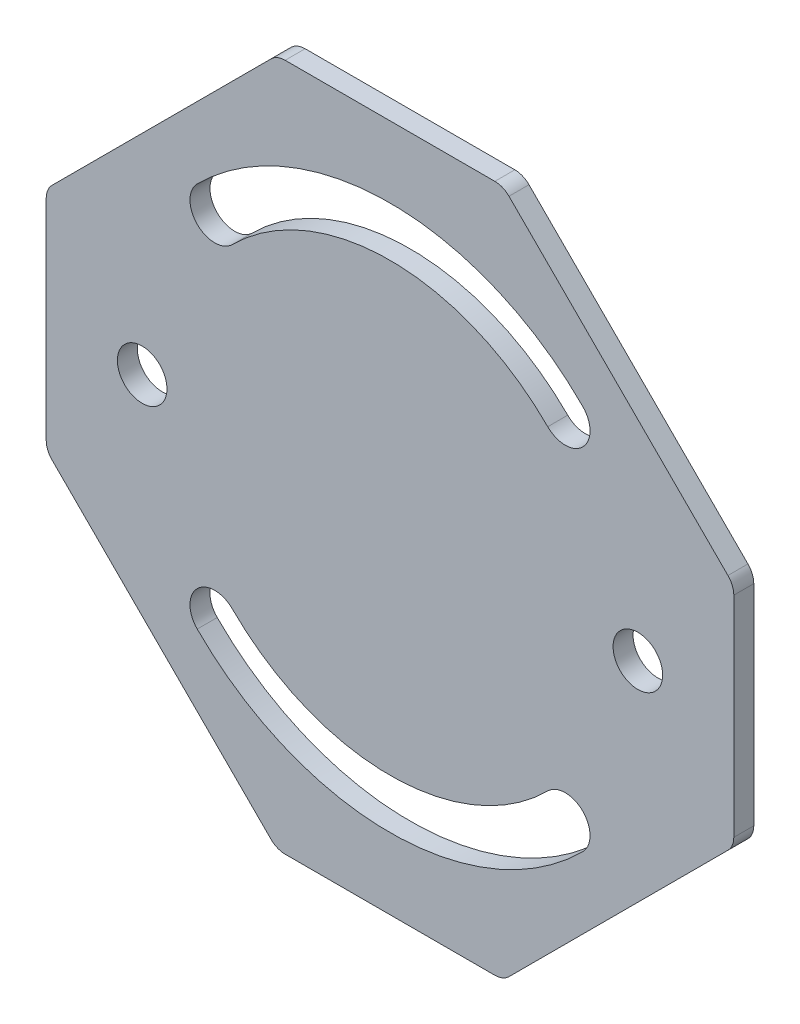
ISO-10303-21;
HEADER;
FILE_DESCRIPTION(('STEP AP214'),'2;1');
FILE_NAME('part.step','',(''),(''),'','','');
FILE_SCHEMA(('AUTOMOTIVE_DESIGN { 1 0 10303 214 1 1 1 1 }'));
ENDSEC;
DATA;
#1=APPLICATION_CONTEXT('core data for automotive mechanical design processes');
#2=APPLICATION_PROTOCOL_DEFINITION('international standard','automotive_design',2000,#1);
#3=PRODUCT_CONTEXT('',#1,'mechanical');
#4=PRODUCT('Part','Part','',(#3));
#5=PRODUCT_RELATED_PRODUCT_CATEGORY('part','',(#4));
#6=PRODUCT_DEFINITION_FORMATION('','',#4);
#7=PRODUCT_DEFINITION_CONTEXT('part definition',#1,'design');
#8=PRODUCT_DEFINITION('design','',#6,#7);
#9=PRODUCT_DEFINITION_SHAPE('','',#8);
#10=(LENGTH_UNIT() NAMED_UNIT(*) SI_UNIT(.MILLI.,.METRE.));
#11=(NAMED_UNIT(*) PLANE_ANGLE_UNIT() SI_UNIT($,.RADIAN.));
#12=(NAMED_UNIT(*) SI_UNIT($,.STERADIAN.) SOLID_ANGLE_UNIT());
#13=UNCERTAINTY_MEASURE_WITH_UNIT(LENGTH_MEASURE(1.E-05),#10,'distance_accuracy_value','');
#14=(GEOMETRIC_REPRESENTATION_CONTEXT(3) GLOBAL_UNCERTAINTY_ASSIGNED_CONTEXT((#13)) GLOBAL_UNIT_ASSIGNED_CONTEXT((#10,
#11,#12)) REPRESENTATION_CONTEXT('',''));
#15=CARTESIAN_POINT('',(0.,0.,0.));
#16=DIRECTION('',(0.,0.,1.));
#17=DIRECTION('',(1.,0.,0.));
#18=AXIS2_PLACEMENT_3D('',#15,#16,#17);
#19=CARTESIAN_POINT('',(0.,0.,2.5));
#20=DIRECTION('',(0.,0.,-1.));
#21=DIRECTION('',(-1.,0.,0.));
#22=AXIS2_PLACEMENT_3D('',#19,#20,#21);
#23=PLANE('',#22);
#24=CARTESIAN_POINT('',(-21.9203102167831,-21.9203102167829,2.5));
#25=DIRECTION('',(0.,0.,1.));
#26=DIRECTION('',(1.,0.,0.));
#27=AXIS2_PLACEMENT_3D('',#24,#25,#26);
#28=CIRCLE('',#27,3.1);
#29=CARTESIAN_POINT('',(-19.7282791951048,-19.7282791951046,2.5));
#30=VERTEX_POINT('',#29);
#31=CARTESIAN_POINT('',(-24.1123412384614,-24.1123412384612,2.5));
#32=VERTEX_POINT('',#31);
#33=EDGE_CURVE('E219',#30,#32,#28,.T.);
#34=ORIENTED_EDGE('',*,*,#33,.F.);
#35=CARTESIAN_POINT('',(0.,0.,2.5));
#36=DIRECTION('',(0.,0.,-1.));
#37=DIRECTION('',(1.,0.,0.));
#38=AXIS2_PLACEMENT_3D('',#35,#36,#37);
#39=CIRCLE('',#38,27.9);
#40=CARTESIAN_POINT('',(19.7282791951048,-19.7282791951046,2.5));
#41=VERTEX_POINT('',#40);
#42=EDGE_CURVE('E227',#41,#30,#39,.T.);
#43=ORIENTED_EDGE('',*,*,#42,.F.);
#44=CARTESIAN_POINT('',(21.9203102167831,-21.9203102167829,2.5));
#45=DIRECTION('',(0.,0.,1.));
#46=DIRECTION('',(1.,0.,0.));
#47=AXIS2_PLACEMENT_3D('',#44,#45,#46);
#48=CIRCLE('',#47,3.1);
#49=CARTESIAN_POINT('',(24.1123412384614,-24.1123412384611,2.5));
#50=VERTEX_POINT('',#49);
#51=EDGE_CURVE('E224',#50,#41,#48,.T.);
#52=ORIENTED_EDGE('',*,*,#51,.F.);
#53=CARTESIAN_POINT('',(0.,0.,2.5));
#54=DIRECTION('',(0.,0.,1.));
#55=DIRECTION('',(1.,0.,0.));
#56=AXIS2_PLACEMENT_3D('',#53,#54,#55);
#57=CIRCLE('',#56,34.1);
#58=EDGE_CURVE('E221',#32,#50,#57,.T.);
#59=ORIENTED_EDGE('',*,*,#58,.F.);
#60=EDGE_LOOP('',(#34,#43,#52,#59));
#61=FACE_BOUND('',#60,.T.);
#62=DIRECTION('',(-0.707106781186548,0.707106781186547,0.));
#63=VECTOR('',#62,1.);
#64=CARTESIAN_POINT('',(14.15,43.,2.5));
#65=LINE('',#64,#63);
#66=CARTESIAN_POINT('',(42.2677669529664,14.8822330470336,2.5));
#67=VERTEX_POINT('',#66);
#68=CARTESIAN_POINT('',(14.8822330470336,42.2677669529664,2.5));
#69=VERTEX_POINT('',#68);
#70=EDGE_CURVE('E282',#67,#69,#65,.T.);
#71=ORIENTED_EDGE('',*,*,#70,.T.);
#72=CARTESIAN_POINT('',(13.1144660940673,40.5,2.5));
#73=DIRECTION('',(0.,0.,-1.));
#74=DIRECTION('',(-1.,0.,0.));
#75=AXIS2_PLACEMENT_3D('',#72,#73,#74);
#76=CIRCLE('',#75,2.5);
#77=CARTESIAN_POINT('',(13.1144660940673,43.,2.5));
#78=VERTEX_POINT('',#77);
#79=EDGE_CURVE('E345',#69,#78,#76,.F.);
#80=ORIENTED_EDGE('',*,*,#79,.T.);
#81=DIRECTION('',(-1.,0.,0.));
#82=VECTOR('',#81,1.);
#83=CARTESIAN_POINT('',(-14.15,43.,2.5));
#84=LINE('',#83,#82);
#85=CARTESIAN_POINT('',(-13.1144660940673,43.,2.5));
#86=VERTEX_POINT('',#85);
#87=EDGE_CURVE('E262',#78,#86,#84,.T.);
#88=ORIENTED_EDGE('',*,*,#87,.T.);
#89=CARTESIAN_POINT('',(-13.1144660940673,40.5,2.5));
#90=DIRECTION('',(0.,0.,-1.));
#91=DIRECTION('',(-1.,0.,0.));
#92=AXIS2_PLACEMENT_3D('',#89,#90,#91);
#93=CIRCLE('',#92,2.5);
#94=CARTESIAN_POINT('',(-14.8822330470336,42.2677669529664,2.5));
#95=VERTEX_POINT('',#94);
#96=EDGE_CURVE('E332',#86,#95,#93,.F.);
#97=ORIENTED_EDGE('',*,*,#96,.T.);
#98=DIRECTION('',(-0.707106781186547,-0.707106781186548,0.));
#99=VECTOR('',#98,1.);
#100=CARTESIAN_POINT('',(-43.,14.15,2.5));
#101=LINE('',#100,#99);
#102=CARTESIAN_POINT('',(-42.2677669529664,14.8822330470336,2.5));
#103=VERTEX_POINT('',#102);
#104=EDGE_CURVE('E265',#95,#103,#101,.T.);
#105=ORIENTED_EDGE('',*,*,#104,.T.);
#106=CARTESIAN_POINT('',(-40.5,13.1144660940673,2.5));
#107=DIRECTION('',(0.,0.,-1.));
#108=DIRECTION('',(-1.,0.,0.));
#109=AXIS2_PLACEMENT_3D('',#106,#107,#108);
#110=CIRCLE('',#109,2.5);
#111=CARTESIAN_POINT('',(-43.,13.1144660940673,2.5));
#112=VERTEX_POINT('',#111);
#113=EDGE_CURVE('E334',#103,#112,#110,.F.);
#114=ORIENTED_EDGE('',*,*,#113,.T.);
#115=DIRECTION('',(0.,-1.,0.));
#116=VECTOR('',#115,1.);
#117=CARTESIAN_POINT('',(-43.,14.15,2.5));
#118=LINE('',#117,#116);
#119=CARTESIAN_POINT('',(-43.,-13.1144660940673,2.5));
#120=VERTEX_POINT('',#119);
#121=EDGE_CURVE('E269',#112,#120,#118,.T.);
#122=ORIENTED_EDGE('',*,*,#121,.T.);
#123=CARTESIAN_POINT('',(-40.5,-13.1144660940673,2.5));
#124=DIRECTION('',(0.,0.,-1.));
#125=DIRECTION('',(-1.,0.,0.));
#126=AXIS2_PLACEMENT_3D('',#123,#124,#125);
#127=CIRCLE('',#126,2.5);
#128=CARTESIAN_POINT('',(-42.2677669529664,-14.8822330470336,2.5));
#129=VERTEX_POINT('',#128);
#130=EDGE_CURVE('E336',#120,#129,#127,.F.);
#131=ORIENTED_EDGE('',*,*,#130,.T.);
#132=DIRECTION('',(0.707106781186548,-0.707106781186547,0.));
#133=VECTOR('',#132,1.);
#134=CARTESIAN_POINT('',(-43.,-14.15,2.5));
#135=LINE('',#134,#133);
#136=CARTESIAN_POINT('',(-14.8822330470336,-42.2677669529664,2.5));
#137=VERTEX_POINT('',#136);
#138=EDGE_CURVE('E272',#129,#137,#135,.T.);
#139=ORIENTED_EDGE('',*,*,#138,.T.);
#140=CARTESIAN_POINT('',(-13.1144660940673,-40.5,2.5));
#141=DIRECTION('',(0.,0.,-1.));
#142=DIRECTION('',(-1.,0.,0.));
#143=AXIS2_PLACEMENT_3D('',#140,#141,#142);
#144=CIRCLE('',#143,2.5);
#145=CARTESIAN_POINT('',(-13.1144660940673,-43.,2.5));
#146=VERTEX_POINT('',#145);
#147=EDGE_CURVE('E338',#137,#146,#144,.F.);
#148=ORIENTED_EDGE('',*,*,#147,.T.);
#149=DIRECTION('',(1.,0.,0.));
#150=VECTOR('',#149,1.);
#151=CARTESIAN_POINT('',(-14.15,-43.,2.5));
#152=LINE('',#151,#150);
#153=CARTESIAN_POINT('',(13.1144660940673,-43.,2.5));
#154=VERTEX_POINT('',#153);
#155=EDGE_CURVE('E275',#146,#154,#152,.T.);
#156=ORIENTED_EDGE('',*,*,#155,.T.);
#157=CARTESIAN_POINT('',(13.1144660940673,-40.5,2.5));
#158=DIRECTION('',(0.,0.,-1.));
#159=DIRECTION('',(-1.,0.,0.));
#160=AXIS2_PLACEMENT_3D('',#157,#158,#159);
#161=CIRCLE('',#160,2.5);
#162=CARTESIAN_POINT('',(14.8822330470336,-42.2677669529664,2.5));
#163=VERTEX_POINT('',#162);
#164=EDGE_CURVE('E340',#154,#163,#161,.F.);
#165=ORIENTED_EDGE('',*,*,#164,.T.);
#166=DIRECTION('',(0.707106781186548,0.707106781186548,0.));
#167=VECTOR('',#166,1.);
#168=CARTESIAN_POINT('',(14.15,-43.,2.5));
#169=LINE('',#168,#167);
#170=CARTESIAN_POINT('',(42.2677669529664,-14.8822330470336,2.5));
#171=VERTEX_POINT('',#170);
#172=EDGE_CURVE('E278',#163,#171,#169,.T.);
#173=ORIENTED_EDGE('',*,*,#172,.T.);
#174=CARTESIAN_POINT('',(40.5,-13.1144660940673,2.5));
#175=DIRECTION('',(0.,0.,-1.));
#176=DIRECTION('',(-1.,0.,0.));
#177=AXIS2_PLACEMENT_3D('',#174,#175,#176);
#178=CIRCLE('',#177,2.5);
#179=CARTESIAN_POINT('',(43.,-13.1144660940673,2.5));
#180=VERTEX_POINT('',#179);
#181=EDGE_CURVE('E37',#171,#180,#178,.F.);
#182=ORIENTED_EDGE('',*,*,#181,.T.);
#183=DIRECTION('',(0.,1.,0.));
#184=VECTOR('',#183,1.);
#185=CARTESIAN_POINT('',(43.,14.15,2.5));
#186=LINE('',#185,#184);
#187=CARTESIAN_POINT('',(43.,13.1144660940673,2.5));
#188=VERTEX_POINT('',#187);
#189=EDGE_CURVE('E280',#180,#188,#186,.T.);
#190=ORIENTED_EDGE('',*,*,#189,.T.);
#191=CARTESIAN_POINT('',(40.5,13.1144660940673,2.5));
#192=DIRECTION('',(0.,0.,-1.));
#193=DIRECTION('',(-1.,0.,0.));
#194=AXIS2_PLACEMENT_3D('',#191,#192,#193);
#195=CIRCLE('',#194,2.5);
#196=EDGE_CURVE('E343',#188,#67,#195,.F.);
#197=ORIENTED_EDGE('',*,*,#196,.T.);
#198=EDGE_LOOP('',(#71,#80,#88,#97,#105,#114,#122,#131,#139,#148,#156,#165,#173,#182,#190,#197));
#199=FACE_BOUND('',#198,.T.);
#200=CARTESIAN_POINT('',(-31.,0.,2.5));
#201=DIRECTION('',(0.,0.,1.));
#202=DIRECTION('',(1.,0.,0.));
#203=AXIS2_PLACEMENT_3D('',#200,#201,#202);
#204=CIRCLE('',#203,3.1);
#205=CARTESIAN_POINT('',(-27.9,0.,2.5));
#206=VERTEX_POINT('',#205);
#207=EDGE_CURVE('E256',#206,#206,#204,.T.);
#208=ORIENTED_EDGE('',*,*,#207,.F.);
#209=EDGE_LOOP('',(#208));
#210=FACE_BOUND('',#209,.T.);
#211=CARTESIAN_POINT('',(31.,0.,2.5));
#212=DIRECTION('',(0.,0.,1.));
#213=DIRECTION('',(1.,0.,0.));
#214=AXIS2_PLACEMENT_3D('',#211,#212,#213);
#215=CIRCLE('',#214,3.1);
#216=CARTESIAN_POINT('',(34.1,0.,2.5));
#217=VERTEX_POINT('',#216);
#218=EDGE_CURVE('E250',#217,#217,#215,.T.);
#219=ORIENTED_EDGE('',*,*,#218,.F.);
#220=EDGE_LOOP('',(#219));
#221=FACE_BOUND('',#220,.T.);
#222=CARTESIAN_POINT('',(-21.9203102167831,21.9203102167829,2.5));
#223=DIRECTION('',(0.,0.,1.));
#224=DIRECTION('',(-1.,0.,0.));
#225=AXIS2_PLACEMENT_3D('',#222,#223,#224);
#226=CIRCLE('',#225,3.10000000000001);
#227=CARTESIAN_POINT('',(-24.1123412384614,24.1123412384612,2.5));
#228=VERTEX_POINT('',#227);
#229=CARTESIAN_POINT('',(-19.7282791951048,19.7282791951046,2.5));
#230=VERTEX_POINT('',#229);
#231=EDGE_CURVE('E178',#228,#230,#226,.T.);
#232=ORIENTED_EDGE('',*,*,#231,.F.);
#233=CARTESIAN_POINT('',(0.,0.,2.5));
#234=DIRECTION('',(0.,0.,1.));
#235=DIRECTION('',(-1.,0.,0.));
#236=AXIS2_PLACEMENT_3D('',#233,#234,#235);
#237=CIRCLE('',#236,34.1);
#238=CARTESIAN_POINT('',(24.1123412384614,24.1123412384611,2.5));
#239=VERTEX_POINT('',#238);
#240=EDGE_CURVE('E203',#239,#228,#237,.T.);
#241=ORIENTED_EDGE('',*,*,#240,.F.);
#242=CARTESIAN_POINT('',(21.9203102167831,21.9203102167829,2.5));
#243=DIRECTION('',(0.,0.,1.));
#244=DIRECTION('',(-1.,0.,0.));
#245=AXIS2_PLACEMENT_3D('',#242,#243,#244);
#246=CIRCLE('',#245,3.10000000000001);
#247=CARTESIAN_POINT('',(19.7282791951048,19.7282791951046,2.5));
#248=VERTEX_POINT('',#247);
#249=EDGE_CURVE('E201',#248,#239,#246,.T.);
#250=ORIENTED_EDGE('',*,*,#249,.F.);
#251=CARTESIAN_POINT('',(0.,0.,2.5));
#252=DIRECTION('',(0.,0.,-1.));
#253=DIRECTION('',(-1.,0.,0.));
#254=AXIS2_PLACEMENT_3D('',#251,#252,#253);
#255=CIRCLE('',#254,27.9);
#256=EDGE_CURVE('E188',#230,#248,#255,.T.);
#257=ORIENTED_EDGE('',*,*,#256,.F.);
#258=EDGE_LOOP('',(#232,#241,#250,#257));
#259=FACE_BOUND('',#258,.T.);
#260=ADVANCED_FACE('F15',(#61,#199,#210,#221,#259),#23,.F.);
#261=CARTESIAN_POINT('',(0.,0.,0.));
#262=DIRECTION('',(0.,0.,-1.));
#263=DIRECTION('',(-1.,0.,0.));
#264=AXIS2_PLACEMENT_3D('',#261,#262,#263);
#265=PLANE('',#264);
#266=CARTESIAN_POINT('',(-31.,0.,0.));
#267=DIRECTION('',(0.,0.,1.));
#268=DIRECTION('',(1.,0.,0.));
#269=AXIS2_PLACEMENT_3D('',#266,#267,#268);
#270=CIRCLE('',#269,3.1);
#271=CARTESIAN_POINT('',(-27.9,0.,0.));
#272=VERTEX_POINT('',#271);
#273=EDGE_CURVE('E253',#272,#272,#270,.T.);
#274=ORIENTED_EDGE('',*,*,#273,.T.);
#275=EDGE_LOOP('',(#274));
#276=FACE_BOUND('',#275,.T.);
#277=DIRECTION('',(-1.,0.,0.));
#278=VECTOR('',#277,1.);
#279=CARTESIAN_POINT('',(-14.15,43.,0.));
#280=LINE('',#279,#278);
#281=CARTESIAN_POINT('',(13.1144660940673,43.,0.));
#282=VERTEX_POINT('',#281);
#283=CARTESIAN_POINT('',(-13.1144660940673,43.,0.));
#284=VERTEX_POINT('',#283);
#285=EDGE_CURVE('E259',#282,#284,#280,.T.);
#286=ORIENTED_EDGE('',*,*,#285,.F.);
#287=CARTESIAN_POINT('',(13.1144660940673,40.5,0.));
#288=DIRECTION('',(0.,0.,-1.));
#289=DIRECTION('',(-1.,0.,0.));
#290=AXIS2_PLACEMENT_3D('',#287,#288,#289);
#291=CIRCLE('',#290,2.5);
#292=CARTESIAN_POINT('',(14.8822330470336,42.2677669529664,0.));
#293=VERTEX_POINT('',#292);
#294=EDGE_CURVE('E325',#282,#293,#291,.T.);
#295=ORIENTED_EDGE('',*,*,#294,.T.);
#296=DIRECTION('',(-0.707106781186548,0.707106781186547,0.));
#297=VECTOR('',#296,1.);
#298=CARTESIAN_POINT('',(14.15,43.,0.));
#299=LINE('',#298,#297);
#300=CARTESIAN_POINT('',(42.2677669529664,14.8822330470336,0.));
#301=VERTEX_POINT('',#300);
#302=EDGE_CURVE('E266',#301,#293,#299,.T.);
#303=ORIENTED_EDGE('',*,*,#302,.F.);
#304=CARTESIAN_POINT('',(40.5,13.1144660940673,0.));
#305=DIRECTION('',(0.,0.,-1.));
#306=DIRECTION('',(-1.,0.,0.));
#307=AXIS2_PLACEMENT_3D('',#304,#305,#306);
#308=CIRCLE('',#307,2.5);
#309=CARTESIAN_POINT('',(43.,13.1144660940673,0.));
#310=VERTEX_POINT('',#309);
#311=EDGE_CURVE('E323',#301,#310,#308,.T.);
#312=ORIENTED_EDGE('',*,*,#311,.T.);
#313=DIRECTION('',(0.,1.,0.));
#314=VECTOR('',#313,1.);
#315=CARTESIAN_POINT('',(43.,14.15,0.));
#316=LINE('',#315,#314);
#317=CARTESIAN_POINT('',(43.,-13.1144660940673,0.));
#318=VERTEX_POINT('',#317);
#319=EDGE_CURVE('E303',#318,#310,#316,.T.);
#320=ORIENTED_EDGE('',*,*,#319,.F.);
#321=CARTESIAN_POINT('',(40.5,-13.1144660940673,0.));
#322=DIRECTION('',(0.,0.,-1.));
#323=DIRECTION('',(-1.,0.,0.));
#324=AXIS2_PLACEMENT_3D('',#321,#322,#323);
#325=CIRCLE('',#324,2.5);
#326=CARTESIAN_POINT('',(42.2677669529664,-14.8822330470336,0.));
#327=VERTEX_POINT('',#326);
#328=EDGE_CURVE('E321',#318,#327,#325,.T.);
#329=ORIENTED_EDGE('',*,*,#328,.T.);
#330=DIRECTION('',(0.707106781186548,0.707106781186548,0.));
#331=VECTOR('',#330,1.);
#332=CARTESIAN_POINT('',(14.15,-43.,0.));
#333=LINE('',#332,#331);
#334=CARTESIAN_POINT('',(14.8822330470336,-42.2677669529664,0.));
#335=VERTEX_POINT('',#334);
#336=EDGE_CURVE('E300',#335,#327,#333,.T.);
#337=ORIENTED_EDGE('',*,*,#336,.F.);
#338=CARTESIAN_POINT('',(13.1144660940673,-40.5,0.));
#339=DIRECTION('',(0.,0.,-1.));
#340=DIRECTION('',(-1.,0.,0.));
#341=AXIS2_PLACEMENT_3D('',#338,#339,#340);
#342=CIRCLE('',#341,2.5);
#343=CARTESIAN_POINT('',(13.1144660940673,-43.,0.));
#344=VERTEX_POINT('',#343);
#345=EDGE_CURVE('E319',#335,#344,#342,.T.);
#346=ORIENTED_EDGE('',*,*,#345,.T.);
#347=DIRECTION('',(1.,0.,0.));
#348=VECTOR('',#347,1.);
#349=CARTESIAN_POINT('',(-14.15,-43.,0.));
#350=LINE('',#349,#348);
#351=CARTESIAN_POINT('',(-13.1144660940673,-43.,0.));
#352=VERTEX_POINT('',#351);
#353=EDGE_CURVE('E297',#352,#344,#350,.T.);
#354=ORIENTED_EDGE('',*,*,#353,.F.);
#355=CARTESIAN_POINT('',(-13.1144660940673,-40.5,0.));
#356=DIRECTION('',(0.,0.,-1.));
#357=DIRECTION('',(-1.,0.,0.));
#358=AXIS2_PLACEMENT_3D('',#355,#356,#357);
#359=CIRCLE('',#358,2.5);
#360=CARTESIAN_POINT('',(-14.8822330470336,-42.2677669529664,0.));
#361=VERTEX_POINT('',#360);
#362=EDGE_CURVE('E317',#352,#361,#359,.T.);
#363=ORIENTED_EDGE('',*,*,#362,.T.);
#364=DIRECTION('',(0.707106781186548,-0.707106781186547,0.));
#365=VECTOR('',#364,1.);
#366=CARTESIAN_POINT('',(-43.,-14.15,0.));
#367=LINE('',#366,#365);
#368=CARTESIAN_POINT('',(-42.2677669529664,-14.8822330470336,0.));
#369=VERTEX_POINT('',#368);
#370=EDGE_CURVE('E294',#369,#361,#367,.T.);
#371=ORIENTED_EDGE('',*,*,#370,.F.);
#372=CARTESIAN_POINT('',(-40.5,-13.1144660940673,0.));
#373=DIRECTION('',(0.,0.,-1.));
#374=DIRECTION('',(-1.,0.,0.));
#375=AXIS2_PLACEMENT_3D('',#372,#373,#374);
#376=CIRCLE('',#375,2.5);
#377=CARTESIAN_POINT('',(-43.,-13.1144660940673,0.));
#378=VERTEX_POINT('',#377);
#379=EDGE_CURVE('E315',#369,#378,#376,.T.);
#380=ORIENTED_EDGE('',*,*,#379,.T.);
#381=DIRECTION('',(0.,-1.,0.));
#382=VECTOR('',#381,1.);
#383=CARTESIAN_POINT('',(-43.,14.15,0.));
#384=LINE('',#383,#382);
#385=CARTESIAN_POINT('',(-43.,13.1144660940673,0.));
#386=VERTEX_POINT('',#385);
#387=EDGE_CURVE('E291',#386,#378,#384,.T.);
#388=ORIENTED_EDGE('',*,*,#387,.F.);
#389=CARTESIAN_POINT('',(-40.5,13.1144660940673,0.));
#390=DIRECTION('',(0.,0.,-1.));
#391=DIRECTION('',(-1.,0.,0.));
#392=AXIS2_PLACEMENT_3D('',#389,#390,#391);
#393=CIRCLE('',#392,2.5);
#394=CARTESIAN_POINT('',(-42.2677669529664,14.8822330470336,0.));
#395=VERTEX_POINT('',#394);
#396=EDGE_CURVE('E313',#386,#395,#393,.T.);
#397=ORIENTED_EDGE('',*,*,#396,.T.);
#398=DIRECTION('',(-0.707106781186547,-0.707106781186548,0.));
#399=VECTOR('',#398,1.);
#400=CARTESIAN_POINT('',(-43.,14.15,0.));
#401=LINE('',#400,#399);
#402=CARTESIAN_POINT('',(-14.8822330470336,42.2677669529664,0.));
#403=VERTEX_POINT('',#402);
#404=EDGE_CURVE('E288',#403,#395,#401,.T.);
#405=ORIENTED_EDGE('',*,*,#404,.F.);
#406=CARTESIAN_POINT('',(-13.1144660940673,40.5,0.));
#407=DIRECTION('',(0.,0.,-1.));
#408=DIRECTION('',(-1.,0.,0.));
#409=AXIS2_PLACEMENT_3D('',#406,#407,#408);
#410=CIRCLE('',#409,2.5);
#411=EDGE_CURVE('E311',#403,#284,#410,.T.);
#412=ORIENTED_EDGE('',*,*,#411,.T.);
#413=EDGE_LOOP('',(#286,#295,#303,#312,#320,#329,#337,#346,#354,#363,#371,#380,#388,#397,#405,#412));
#414=FACE_BOUND('',#413,.T.);
#415=CARTESIAN_POINT('',(31.,0.,0.));
#416=DIRECTION('',(0.,0.,1.));
#417=DIRECTION('',(1.,0.,0.));
#418=AXIS2_PLACEMENT_3D('',#415,#416,#417);
#419=CIRCLE('',#418,3.1);
#420=CARTESIAN_POINT('',(34.1,0.,0.));
#421=VERTEX_POINT('',#420);
#422=EDGE_CURVE('E249',#421,#421,#419,.T.);
#423=ORIENTED_EDGE('',*,*,#422,.T.);
#424=EDGE_LOOP('',(#423));
#425=FACE_BOUND('',#424,.T.);
#426=CARTESIAN_POINT('',(0.,0.,0.));
#427=DIRECTION('',(0.,0.,-1.));
#428=DIRECTION('',(1.,0.,0.));
#429=AXIS2_PLACEMENT_3D('',#426,#427,#428);
#430=CIRCLE('',#429,27.9);
#431=CARTESIAN_POINT('',(19.7282791951048,-19.7282791951046,0.));
#432=VERTEX_POINT('',#431);
#433=CARTESIAN_POINT('',(-19.7282791951048,-19.7282791951046,0.));
#434=VERTEX_POINT('',#433);
#435=EDGE_CURVE('E222',#432,#434,#430,.T.);
#436=ORIENTED_EDGE('',*,*,#435,.T.);
#437=CARTESIAN_POINT('',(-21.9203102167831,-21.9203102167829,0.));
#438=DIRECTION('',(0.,0.,1.));
#439=DIRECTION('',(1.,0.,0.));
#440=AXIS2_PLACEMENT_3D('',#437,#438,#439);
#441=CIRCLE('',#440,3.1);
#442=CARTESIAN_POINT('',(-24.1123412384614,-24.1123412384612,0.));
#443=VERTEX_POINT('',#442);
#444=EDGE_CURVE('E196',#434,#443,#441,.T.);
#445=ORIENTED_EDGE('',*,*,#444,.T.);
#446=CARTESIAN_POINT('',(0.,0.,0.));
#447=DIRECTION('',(0.,0.,1.));
#448=DIRECTION('',(1.,0.,0.));
#449=AXIS2_PLACEMENT_3D('',#446,#447,#448);
#450=CIRCLE('',#449,34.1);
#451=CARTESIAN_POINT('',(24.1123412384614,-24.1123412384611,0.));
#452=VERTEX_POINT('',#451);
#453=EDGE_CURVE('E232',#443,#452,#450,.T.);
#454=ORIENTED_EDGE('',*,*,#453,.T.);
#455=CARTESIAN_POINT('',(21.9203102167831,-21.9203102167829,0.));
#456=DIRECTION('',(0.,0.,1.));
#457=DIRECTION('',(1.,0.,0.));
#458=AXIS2_PLACEMENT_3D('',#455,#456,#457);
#459=CIRCLE('',#458,3.1);
#460=EDGE_CURVE('E235',#452,#432,#459,.T.);
#461=ORIENTED_EDGE('',*,*,#460,.T.);
#462=EDGE_LOOP('',(#436,#445,#454,#461));
#463=FACE_BOUND('',#462,.T.);
#464=CARTESIAN_POINT('',(0.,0.,0.));
#465=DIRECTION('',(0.,0.,1.));
#466=DIRECTION('',(-1.,0.,0.));
#467=AXIS2_PLACEMENT_3D('',#464,#465,#466);
#468=CIRCLE('',#467,34.1);
#469=CARTESIAN_POINT('',(24.1123412384614,24.1123412384611,0.));
#470=VERTEX_POINT('',#469);
#471=CARTESIAN_POINT('',(-24.1123412384614,24.1123412384612,0.));
#472=VERTEX_POINT('',#471);
#473=EDGE_CURVE('E189',#470,#472,#468,.T.);
#474=ORIENTED_EDGE('',*,*,#473,.T.);
#475=CARTESIAN_POINT('',(-21.9203102167831,21.9203102167829,0.));
#476=DIRECTION('',(0.,0.,1.));
#477=DIRECTION('',(-1.,0.,0.));
#478=AXIS2_PLACEMENT_3D('',#475,#476,#477);
#479=CIRCLE('',#478,3.10000000000001);
#480=CARTESIAN_POINT('',(-19.7282791951048,19.7282791951046,0.));
#481=VERTEX_POINT('',#480);
#482=EDGE_CURVE('E207',#472,#481,#479,.T.);
#483=ORIENTED_EDGE('',*,*,#482,.T.);
#484=CARTESIAN_POINT('',(0.,0.,0.));
#485=DIRECTION('',(0.,0.,-1.));
#486=DIRECTION('',(-1.,0.,0.));
#487=AXIS2_PLACEMENT_3D('',#484,#485,#486);
#488=CIRCLE('',#487,27.9);
#489=CARTESIAN_POINT('',(19.7282791951048,19.7282791951046,0.));
#490=VERTEX_POINT('',#489);
#491=EDGE_CURVE('E195',#481,#490,#488,.T.);
#492=ORIENTED_EDGE('',*,*,#491,.T.);
#493=CARTESIAN_POINT('',(21.9203102167831,21.9203102167829,0.));
#494=DIRECTION('',(0.,0.,1.));
#495=DIRECTION('',(-1.,0.,0.));
#496=AXIS2_PLACEMENT_3D('',#493,#494,#495);
#497=CIRCLE('',#496,3.10000000000001);
#498=EDGE_CURVE('E210',#490,#470,#497,.T.);
#499=ORIENTED_EDGE('',*,*,#498,.T.);
#500=EDGE_LOOP('',(#474,#483,#492,#499));
#501=FACE_BOUND('',#500,.T.);
#502=ADVANCED_FACE('F381',(#276,#414,#425,#463,#501),#265,.T.);
#503=CARTESIAN_POINT('',(-14.15,43.,2.5));
#504=DIRECTION('',(0.,-1.,0.));
#505=DIRECTION('',(0.,0.,-1.));
#506=AXIS2_PLACEMENT_3D('',#503,#504,#505);
#507=PLANE('',#506);
#508=ORIENTED_EDGE('',*,*,#87,.F.);
#509=DIRECTION('',(0.,0.,-1.));
#510=VECTOR('',#509,1.);
#511=CARTESIAN_POINT('',(13.1144660940673,43.,2.5));
#512=LINE('',#511,#510);
#513=EDGE_CURVE('E308',#78,#282,#512,.T.);
#514=ORIENTED_EDGE('',*,*,#513,.T.);
#515=ORIENTED_EDGE('',*,*,#285,.T.);
#516=DIRECTION('',(0.,0.,-1.));
#517=VECTOR('',#516,1.);
#518=CARTESIAN_POINT('',(-13.1144660940673,43.,2.5));
#519=LINE('',#518,#517);
#520=EDGE_CURVE('E285',#284,#86,#519,.F.);
#521=ORIENTED_EDGE('',*,*,#520,.T.);
#522=EDGE_LOOP('',(#508,#514,#515,#521));
#523=FACE_BOUND('',#522,.T.);
#524=ADVANCED_FACE('F440',(#523),#507,.F.);
#525=CARTESIAN_POINT('',(-43.,14.15,2.5));
#526=DIRECTION('',(0.707106781186548,-0.707106781186547,0.));
#527=DIRECTION('',(0.707106781186547,0.707106781186548,0.));
#528=AXIS2_PLACEMENT_3D('',#525,#526,#527);
#529=PLANE('',#528);
#530=ORIENTED_EDGE('',*,*,#404,.T.);
#531=DIRECTION('',(0.,0.,-1.));
#532=VECTOR('',#531,1.);
#533=CARTESIAN_POINT('',(-42.2677669529664,14.8822330470336,2.5));
#534=LINE('',#533,#532);
#535=EDGE_CURVE('E9',#395,#103,#534,.F.);
#536=ORIENTED_EDGE('',*,*,#535,.T.);
#537=ORIENTED_EDGE('',*,*,#104,.F.);
#538=DIRECTION('',(0.,0.,-1.));
#539=VECTOR('',#538,1.);
#540=CARTESIAN_POINT('',(-14.8822330470336,42.2677669529664,2.5));
#541=LINE('',#540,#539);
#542=EDGE_CURVE('E23',#95,#403,#541,.T.);
#543=ORIENTED_EDGE('',*,*,#542,.T.);
#544=EDGE_LOOP('',(#530,#536,#537,#543));
#545=FACE_BOUND('',#544,.T.);
#546=ADVANCED_FACE('F375',(#545),#529,.F.);
#547=CARTESIAN_POINT('',(-43.,14.15,2.5));
#548=DIRECTION('',(1.,0.,0.));
#549=DIRECTION('',(0.,0.,-1.));
#550=AXIS2_PLACEMENT_3D('',#547,#548,#549);
#551=PLANE('',#550);
#552=ORIENTED_EDGE('',*,*,#387,.T.);
#553=DIRECTION('',(0.,0.,-1.));
#554=VECTOR('',#553,1.);
#555=CARTESIAN_POINT('',(-43.,-13.1144660940673,2.5));
#556=LINE('',#555,#554);
#557=EDGE_CURVE('E369',#378,#120,#556,.F.);
#558=ORIENTED_EDGE('',*,*,#557,.T.);
#559=ORIENTED_EDGE('',*,*,#121,.F.);
#560=DIRECTION('',(0.,0.,-1.));
#561=VECTOR('',#560,1.);
#562=CARTESIAN_POINT('',(-43.,13.1144660940673,2.5));
#563=LINE('',#562,#561);
#564=EDGE_CURVE('E366',#112,#386,#563,.T.);
#565=ORIENTED_EDGE('',*,*,#564,.T.);
#566=EDGE_LOOP('',(#552,#558,#559,#565));
#567=FACE_BOUND('',#566,.T.);
#568=ADVANCED_FACE('F390',(#567),#551,.F.);
#569=CARTESIAN_POINT('',(-43.,-14.15,2.5));
#570=DIRECTION('',(0.707106781186547,0.707106781186548,0.));
#571=DIRECTION('',(-0.707106781186548,0.707106781186547,0.));
#572=AXIS2_PLACEMENT_3D('',#569,#570,#571);
#573=PLANE('',#572);
#574=ORIENTED_EDGE('',*,*,#370,.T.);
#575=DIRECTION('',(0.,0.,-1.));
#576=VECTOR('',#575,1.);
#577=CARTESIAN_POINT('',(-14.8822330470336,-42.2677669529664,2.5));
#578=LINE('',#577,#576);
#579=EDGE_CURVE('E364',#361,#137,#578,.F.);
#580=ORIENTED_EDGE('',*,*,#579,.T.);
#581=ORIENTED_EDGE('',*,*,#138,.F.);
#582=DIRECTION('',(0.,0.,-1.));
#583=VECTOR('',#582,1.);
#584=CARTESIAN_POINT('',(-42.2677669529664,-14.8822330470336,2.5));
#585=LINE('',#584,#583);
#586=EDGE_CURVE('E361',#129,#369,#585,.T.);
#587=ORIENTED_EDGE('',*,*,#586,.T.);
#588=EDGE_LOOP('',(#574,#580,#581,#587));
#589=FACE_BOUND('',#588,.T.);
#590=ADVANCED_FACE('F400',(#589),#573,.F.);
#591=CARTESIAN_POINT('',(-14.15,-43.,2.5));
#592=DIRECTION('',(0.,1.,0.));
#593=DIRECTION('',(0.,0.,1.));
#594=AXIS2_PLACEMENT_3D('',#591,#592,#593);
#595=PLANE('',#594);
#596=ORIENTED_EDGE('',*,*,#353,.T.);
#597=DIRECTION('',(0.,0.,-1.));
#598=VECTOR('',#597,1.);
#599=CARTESIAN_POINT('',(13.1144660940673,-43.,2.5));
#600=LINE('',#599,#598);
#601=EDGE_CURVE('E359',#344,#154,#600,.F.);
#602=ORIENTED_EDGE('',*,*,#601,.T.);
#603=ORIENTED_EDGE('',*,*,#155,.F.);
#604=DIRECTION('',(0.,0.,-1.));
#605=VECTOR('',#604,1.);
#606=CARTESIAN_POINT('',(-13.1144660940673,-43.,2.5));
#607=LINE('',#606,#605);
#608=EDGE_CURVE('E356',#146,#352,#607,.T.);
#609=ORIENTED_EDGE('',*,*,#608,.T.);
#610=EDGE_LOOP('',(#596,#602,#603,#609));
#611=FACE_BOUND('',#610,.T.);
#612=ADVANCED_FACE('F409',(#611),#595,.F.);
#613=CARTESIAN_POINT('',(14.15,-43.,2.5));
#614=DIRECTION('',(-0.707106781186548,0.707106781186548,0.));
#615=DIRECTION('',(-0.707106781186548,-0.707106781186548,0.));
#616=AXIS2_PLACEMENT_3D('',#613,#614,#615);
#617=PLANE('',#616);
#618=ORIENTED_EDGE('',*,*,#336,.T.);
#619=DIRECTION('',(0.,0.,-1.));
#620=VECTOR('',#619,1.);
#621=CARTESIAN_POINT('',(42.2677669529664,-14.8822330470336,2.5));
#622=LINE('',#621,#620);
#623=EDGE_CURVE('E354',#327,#171,#622,.F.);
#624=ORIENTED_EDGE('',*,*,#623,.T.);
#625=ORIENTED_EDGE('',*,*,#172,.F.);
#626=DIRECTION('',(0.,0.,-1.));
#627=VECTOR('',#626,1.);
#628=CARTESIAN_POINT('',(14.8822330470336,-42.2677669529664,2.5));
#629=LINE('',#628,#627);
#630=EDGE_CURVE('E351',#163,#335,#629,.T.);
#631=ORIENTED_EDGE('',*,*,#630,.T.);
#632=EDGE_LOOP('',(#618,#624,#625,#631));
#633=FACE_BOUND('',#632,.T.);
#634=ADVANCED_FACE('F418',(#633),#617,.F.);
#635=CARTESIAN_POINT('',(43.,14.15,2.5));
#636=DIRECTION('',(-1.,0.,0.));
#637=DIRECTION('',(0.,-1.,0.));
#638=AXIS2_PLACEMENT_3D('',#635,#636,#637);
#639=PLANE('',#638);
#640=ORIENTED_EDGE('',*,*,#319,.T.);
#641=DIRECTION('',(0.,0.,-1.));
#642=VECTOR('',#641,1.);
#643=CARTESIAN_POINT('',(43.,13.1144660940673,2.5));
#644=LINE('',#643,#642);
#645=EDGE_CURVE('E30',#310,#188,#644,.F.);
#646=ORIENTED_EDGE('',*,*,#645,.T.);
#647=ORIENTED_EDGE('',*,*,#189,.F.);
#648=DIRECTION('',(0.,0.,-1.));
#649=VECTOR('',#648,1.);
#650=CARTESIAN_POINT('',(43.,-13.1144660940673,2.5));
#651=LINE('',#650,#649);
#652=EDGE_CURVE('E347',#180,#318,#651,.T.);
#653=ORIENTED_EDGE('',*,*,#652,.T.);
#654=EDGE_LOOP('',(#640,#646,#647,#653));
#655=FACE_BOUND('',#654,.T.);
#656=ADVANCED_FACE('F424',(#655),#639,.F.);
#657=CARTESIAN_POINT('',(14.15,43.,2.5));
#658=DIRECTION('',(-0.707106781186547,-0.707106781186548,0.));
#659=DIRECTION('',(0.707106781186548,-0.707106781186547,0.));
#660=AXIS2_PLACEMENT_3D('',#657,#658,#659);
#661=PLANE('',#660);
#662=ORIENTED_EDGE('',*,*,#302,.T.);
#663=DIRECTION('',(0.,0.,-1.));
#664=VECTOR('',#663,1.);
#665=CARTESIAN_POINT('',(14.8822330470336,42.2677669529664,2.5));
#666=LINE('',#665,#664);
#667=EDGE_CURVE('E330',#293,#69,#666,.F.);
#668=ORIENTED_EDGE('',*,*,#667,.T.);
#669=ORIENTED_EDGE('',*,*,#70,.F.);
#670=DIRECTION('',(0.,0.,-1.));
#671=VECTOR('',#670,1.);
#672=CARTESIAN_POINT('',(42.2677669529664,14.8822330470336,2.5));
#673=LINE('',#672,#671);
#674=EDGE_CURVE('E327',#67,#301,#673,.T.);
#675=ORIENTED_EDGE('',*,*,#674,.T.);
#676=EDGE_LOOP('',(#662,#668,#669,#675));
#677=FACE_BOUND('',#676,.T.);
#678=ADVANCED_FACE('F432',(#677),#661,.F.);
#679=CARTESIAN_POINT('',(-31.,0.,2.5));
#680=DIRECTION('',(0.,0.,-1.));
#681=DIRECTION('',(-1.,0.,0.));
#682=AXIS2_PLACEMENT_3D('',#679,#680,#681);
#683=CYLINDRICAL_SURFACE('',#682,3.1);
#684=ORIENTED_EDGE('',*,*,#207,.T.);
#685=EDGE_LOOP('',(#684));
#686=FACE_BOUND('',#685,.T.);
#687=ORIENTED_EDGE('',*,*,#273,.F.);
#688=EDGE_LOOP('',(#687));
#689=FACE_BOUND('',#688,.T.);
#690=ADVANCED_FACE('F457',(#686,#689),#683,.F.);
#691=CARTESIAN_POINT('',(31.,0.,2.5));
#692=DIRECTION('',(0.,0.,-1.));
#693=DIRECTION('',(-1.,0.,0.));
#694=AXIS2_PLACEMENT_3D('',#691,#692,#693);
#695=CYLINDRICAL_SURFACE('',#694,3.1);
#696=ORIENTED_EDGE('',*,*,#218,.T.);
#697=EDGE_LOOP('',(#696));
#698=FACE_BOUND('',#697,.T.);
#699=ORIENTED_EDGE('',*,*,#422,.F.);
#700=EDGE_LOOP('',(#699));
#701=FACE_BOUND('',#700,.T.);
#702=ADVANCED_FACE('F651',(#698,#701),#695,.F.);
#703=CARTESIAN_POINT('',(-21.9203102167831,-21.9203102167829,2.5));
#704=DIRECTION('',(0.,0.,-1.));
#705=DIRECTION('',(-1.,0.,0.));
#706=AXIS2_PLACEMENT_3D('',#703,#704,#705);
#707=CYLINDRICAL_SURFACE('',#706,3.1);
#708=ORIENTED_EDGE('',*,*,#444,.F.);
#709=DIRECTION('',(0.,0.,-1.));
#710=VECTOR('',#709,1.);
#711=CARTESIAN_POINT('',(-19.7282791951048,-19.7282791951046,2.5));
#712=LINE('',#711,#710);
#713=EDGE_CURVE('E229',#30,#434,#712,.T.);
#714=ORIENTED_EDGE('',*,*,#713,.F.);
#715=ORIENTED_EDGE('',*,*,#33,.T.);
#716=DIRECTION('',(0.,0.,-1.));
#717=VECTOR('',#716,1.);
#718=CARTESIAN_POINT('',(-24.1123412384614,-24.1123412384612,2.5));
#719=LINE('',#718,#717);
#720=EDGE_CURVE('E246',#32,#443,#719,.T.);
#721=ORIENTED_EDGE('',*,*,#720,.T.);
#722=EDGE_LOOP('',(#708,#714,#715,#721));
#723=FACE_BOUND('',#722,.T.);
#724=ADVANCED_FACE('F642',(#723),#707,.F.);
#725=CARTESIAN_POINT('',(0.,0.,2.5));
#726=DIRECTION('',(0.,0.,-1.));
#727=DIRECTION('',(-1.,0.,0.));
#728=AXIS2_PLACEMENT_3D('',#725,#726,#727);
#729=CYLINDRICAL_SURFACE('',#728,34.1);
#730=ORIENTED_EDGE('',*,*,#453,.F.);
#731=ORIENTED_EDGE('',*,*,#720,.F.);
#732=ORIENTED_EDGE('',*,*,#58,.T.);
#733=DIRECTION('',(0.,0.,-1.));
#734=VECTOR('',#733,1.);
#735=CARTESIAN_POINT('',(24.1123412384614,-24.1123412384611,2.5));
#736=LINE('',#735,#734);
#737=EDGE_CURVE('E244',#50,#452,#736,.T.);
#738=ORIENTED_EDGE('',*,*,#737,.T.);
#739=EDGE_LOOP('',(#730,#731,#732,#738));
#740=FACE_BOUND('',#739,.T.);
#741=ADVANCED_FACE('F633',(#740),#729,.F.);
#742=CARTESIAN_POINT('',(21.9203102167831,-21.9203102167829,2.5));
#743=DIRECTION('',(0.,0.,-1.));
#744=DIRECTION('',(-1.,0.,0.));
#745=AXIS2_PLACEMENT_3D('',#742,#743,#744);
#746=CYLINDRICAL_SURFACE('',#745,3.1);
#747=ORIENTED_EDGE('',*,*,#460,.F.);
#748=ORIENTED_EDGE('',*,*,#737,.F.);
#749=ORIENTED_EDGE('',*,*,#51,.T.);
#750=DIRECTION('',(0.,0.,-1.));
#751=VECTOR('',#750,1.);
#752=CARTESIAN_POINT('',(19.7282791951048,-19.7282791951046,2.5));
#753=LINE('',#752,#751);
#754=EDGE_CURVE('E242',#41,#432,#753,.T.);
#755=ORIENTED_EDGE('',*,*,#754,.T.);
#756=EDGE_LOOP('',(#747,#748,#749,#755));
#757=FACE_BOUND('',#756,.T.);
#758=ADVANCED_FACE('F624',(#757),#746,.F.);
#759=CARTESIAN_POINT('',(0.,0.,2.5));
#760=DIRECTION('',(0.,0.,-1.));
#761=DIRECTION('',(-1.,0.,0.));
#762=AXIS2_PLACEMENT_3D('',#759,#760,#761);
#763=CYLINDRICAL_SURFACE('',#762,27.9);
#764=ORIENTED_EDGE('',*,*,#435,.F.);
#765=ORIENTED_EDGE('',*,*,#754,.F.);
#766=ORIENTED_EDGE('',*,*,#42,.T.);
#767=ORIENTED_EDGE('',*,*,#713,.T.);
#768=EDGE_LOOP('',(#764,#765,#766,#767));
#769=FACE_BOUND('',#768,.T.);
#770=ADVANCED_FACE('F616',(#769),#763,.T.);
#771=CARTESIAN_POINT('',(-21.9203102167831,21.9203102167829,2.5));
#772=DIRECTION('',(0.,0.,-1.));
#773=DIRECTION('',(-1.,0.,0.));
#774=AXIS2_PLACEMENT_3D('',#771,#772,#773);
#775=CYLINDRICAL_SURFACE('',#774,3.10000000000001);
#776=ORIENTED_EDGE('',*,*,#482,.F.);
#777=DIRECTION('',(0.,0.,-1.));
#778=VECTOR('',#777,1.);
#779=CARTESIAN_POINT('',(-24.1123412384614,24.1123412384612,2.5));
#780=LINE('',#779,#778);
#781=EDGE_CURVE('E184',#228,#472,#780,.T.);
#782=ORIENTED_EDGE('',*,*,#781,.F.);
#783=ORIENTED_EDGE('',*,*,#231,.T.);
#784=DIRECTION('',(0.,0.,-1.));
#785=VECTOR('',#784,1.);
#786=CARTESIAN_POINT('',(-19.7282791951048,19.7282791951046,2.5));
#787=LINE('',#786,#785);
#788=EDGE_CURVE('E181',#230,#481,#787,.T.);
#789=ORIENTED_EDGE('',*,*,#788,.T.);
#790=EDGE_LOOP('',(#776,#782,#783,#789));
#791=FACE_BOUND('',#790,.T.);
#792=ADVANCED_FACE('F180',(#791),#775,.F.);
#793=CARTESIAN_POINT('',(0.,0.,2.5));
#794=DIRECTION('',(0.,0.,-1.));
#795=DIRECTION('',(-1.,0.,0.));
#796=AXIS2_PLACEMENT_3D('',#793,#794,#795);
#797=CYLINDRICAL_SURFACE('',#796,27.9);
#798=ORIENTED_EDGE('',*,*,#491,.F.);
#799=ORIENTED_EDGE('',*,*,#788,.F.);
#800=ORIENTED_EDGE('',*,*,#256,.T.);
#801=DIRECTION('',(0.,0.,-1.));
#802=VECTOR('',#801,1.);
#803=CARTESIAN_POINT('',(19.7282791951048,19.7282791951046,2.5));
#804=LINE('',#803,#802);
#805=EDGE_CURVE('E197',#248,#490,#804,.T.);
#806=ORIENTED_EDGE('',*,*,#805,.T.);
#807=EDGE_LOOP('',(#798,#799,#800,#806));
#808=FACE_BOUND('',#807,.T.);
#809=ADVANCED_FACE('F192',(#808),#797,.T.);
#810=CARTESIAN_POINT('',(21.9203102167831,21.9203102167829,2.5));
#811=DIRECTION('',(0.,0.,-1.));
#812=DIRECTION('',(-1.,0.,0.));
#813=AXIS2_PLACEMENT_3D('',#810,#811,#812);
#814=CYLINDRICAL_SURFACE('',#813,3.10000000000001);
#815=ORIENTED_EDGE('',*,*,#498,.F.);
#816=ORIENTED_EDGE('',*,*,#805,.F.);
#817=ORIENTED_EDGE('',*,*,#249,.T.);
#818=DIRECTION('',(0.,0.,-1.));
#819=VECTOR('',#818,1.);
#820=CARTESIAN_POINT('',(24.1123412384614,24.1123412384611,2.5));
#821=LINE('',#820,#819);
#822=EDGE_CURVE('E216',#239,#470,#821,.T.);
#823=ORIENTED_EDGE('',*,*,#822,.T.);
#824=EDGE_LOOP('',(#815,#816,#817,#823));
#825=FACE_BOUND('',#824,.T.);
#826=ADVANCED_FACE('F592',(#825),#814,.F.);
#827=CARTESIAN_POINT('',(0.,0.,2.5));
#828=DIRECTION('',(0.,0.,-1.));
#829=DIRECTION('',(-1.,0.,0.));
#830=AXIS2_PLACEMENT_3D('',#827,#828,#829);
#831=CYLINDRICAL_SURFACE('',#830,34.1);
#832=ORIENTED_EDGE('',*,*,#473,.F.);
#833=ORIENTED_EDGE('',*,*,#822,.F.);
#834=ORIENTED_EDGE('',*,*,#240,.T.);
#835=ORIENTED_EDGE('',*,*,#781,.T.);
#836=EDGE_LOOP('',(#832,#833,#834,#835));
#837=FACE_BOUND('',#836,.T.);
#838=ADVANCED_FACE('F478',(#837),#831,.F.);
#839=CARTESIAN_POINT('',(13.1144660940673,40.5,2.5));
#840=DIRECTION('',(0.,0.,-1.));
#841=DIRECTION('',(-1.,0.,0.));
#842=AXIS2_PLACEMENT_3D('',#839,#840,#841);
#843=CYLINDRICAL_SURFACE('',#842,2.5);
#844=ORIENTED_EDGE('',*,*,#79,.F.);
#845=ORIENTED_EDGE('',*,*,#667,.F.);
#846=ORIENTED_EDGE('',*,*,#294,.F.);
#847=ORIENTED_EDGE('',*,*,#513,.F.);
#848=EDGE_LOOP('',(#844,#845,#846,#847));
#849=FACE_BOUND('',#848,.T.);
#850=ADVANCED_FACE('F437',(#849),#843,.T.);
#851=CARTESIAN_POINT('',(40.5,13.1144660940673,2.5));
#852=DIRECTION('',(0.,0.,-1.));
#853=DIRECTION('',(-1.,0.,0.));
#854=AXIS2_PLACEMENT_3D('',#851,#852,#853);
#855=CYLINDRICAL_SURFACE('',#854,2.5);
#856=ORIENTED_EDGE('',*,*,#196,.F.);
#857=ORIENTED_EDGE('',*,*,#645,.F.);
#858=ORIENTED_EDGE('',*,*,#311,.F.);
#859=ORIENTED_EDGE('',*,*,#674,.F.);
#860=EDGE_LOOP('',(#856,#857,#858,#859));
#861=FACE_BOUND('',#860,.T.);
#862=ADVANCED_FACE('F429',(#861),#855,.T.);
#863=CARTESIAN_POINT('',(40.5,-13.1144660940673,2.5));
#864=DIRECTION('',(0.,0.,-1.));
#865=DIRECTION('',(-1.,0.,0.));
#866=AXIS2_PLACEMENT_3D('',#863,#864,#865);
#867=CYLINDRICAL_SURFACE('',#866,2.5);
#868=ORIENTED_EDGE('',*,*,#181,.F.);
#869=ORIENTED_EDGE('',*,*,#623,.F.);
#870=ORIENTED_EDGE('',*,*,#328,.F.);
#871=ORIENTED_EDGE('',*,*,#652,.F.);
#872=EDGE_LOOP('',(#868,#869,#870,#871));
#873=FACE_BOUND('',#872,.T.);
#874=ADVANCED_FACE('F423',(#873),#867,.T.);
#875=CARTESIAN_POINT('',(13.1144660940673,-40.5,2.5));
#876=DIRECTION('',(0.,0.,-1.));
#877=DIRECTION('',(-1.,0.,0.));
#878=AXIS2_PLACEMENT_3D('',#875,#876,#877);
#879=CYLINDRICAL_SURFACE('',#878,2.5);
#880=ORIENTED_EDGE('',*,*,#164,.F.);
#881=ORIENTED_EDGE('',*,*,#601,.F.);
#882=ORIENTED_EDGE('',*,*,#345,.F.);
#883=ORIENTED_EDGE('',*,*,#630,.F.);
#884=EDGE_LOOP('',(#880,#881,#882,#883));
#885=FACE_BOUND('',#884,.T.);
#886=ADVANCED_FACE('F415',(#885),#879,.T.);
#887=CARTESIAN_POINT('',(-13.1144660940673,-40.5,2.5));
#888=DIRECTION('',(0.,0.,-1.));
#889=DIRECTION('',(-1.,0.,0.));
#890=AXIS2_PLACEMENT_3D('',#887,#888,#889);
#891=CYLINDRICAL_SURFACE('',#890,2.5);
#892=ORIENTED_EDGE('',*,*,#147,.F.);
#893=ORIENTED_EDGE('',*,*,#579,.F.);
#894=ORIENTED_EDGE('',*,*,#362,.F.);
#895=ORIENTED_EDGE('',*,*,#608,.F.);
#896=EDGE_LOOP('',(#892,#893,#894,#895));
#897=FACE_BOUND('',#896,.T.);
#898=ADVANCED_FACE('F406',(#897),#891,.T.);
#899=CARTESIAN_POINT('',(-40.5,-13.1144660940673,2.5));
#900=DIRECTION('',(0.,0.,-1.));
#901=DIRECTION('',(-1.,0.,0.));
#902=AXIS2_PLACEMENT_3D('',#899,#900,#901);
#903=CYLINDRICAL_SURFACE('',#902,2.5);
#904=ORIENTED_EDGE('',*,*,#130,.F.);
#905=ORIENTED_EDGE('',*,*,#557,.F.);
#906=ORIENTED_EDGE('',*,*,#379,.F.);
#907=ORIENTED_EDGE('',*,*,#586,.F.);
#908=EDGE_LOOP('',(#904,#905,#906,#907));
#909=FACE_BOUND('',#908,.T.);
#910=ADVANCED_FACE('F397',(#909),#903,.T.);
#911=CARTESIAN_POINT('',(-40.5,13.1144660940673,2.5));
#912=DIRECTION('',(0.,0.,-1.));
#913=DIRECTION('',(-1.,0.,0.));
#914=AXIS2_PLACEMENT_3D('',#911,#912,#913);
#915=CYLINDRICAL_SURFACE('',#914,2.5);
#916=ORIENTED_EDGE('',*,*,#113,.F.);
#917=ORIENTED_EDGE('',*,*,#535,.F.);
#918=ORIENTED_EDGE('',*,*,#396,.F.);
#919=ORIENTED_EDGE('',*,*,#564,.F.);
#920=EDGE_LOOP('',(#916,#917,#918,#919));
#921=FACE_BOUND('',#920,.T.);
#922=ADVANCED_FACE('F387',(#921),#915,.T.);
#923=CARTESIAN_POINT('',(-13.1144660940673,40.5,2.5));
#924=DIRECTION('',(0.,0.,-1.));
#925=DIRECTION('',(-1.,0.,0.));
#926=AXIS2_PLACEMENT_3D('',#923,#924,#925);
#927=CYLINDRICAL_SURFACE('',#926,2.5);
#928=ORIENTED_EDGE('',*,*,#96,.F.);
#929=ORIENTED_EDGE('',*,*,#520,.F.);
#930=ORIENTED_EDGE('',*,*,#411,.F.);
#931=ORIENTED_EDGE('',*,*,#542,.F.);
#932=EDGE_LOOP('',(#928,#929,#930,#931));
#933=FACE_BOUND('',#932,.T.);
#934=ADVANCED_FACE('F17',(#933),#927,.T.);
#935=CLOSED_SHELL('',(#260,#502,#524,#546,#568,#590,#612,#634,#656,#678,#690,#702,#724,#741,
#758,#770,#792,#809,#826,#838,#850,#862,#874,#886,#898,#910,#922,#934));
#936=MANIFOLD_SOLID_BREP('B1',#935);
#937=ADVANCED_BREP_SHAPE_REPRESENTATION('',(#18,#936),#14);
#938=SHAPE_DEFINITION_REPRESENTATION(#9,#937);
ENDSEC;
END-ISO-10303-21;
